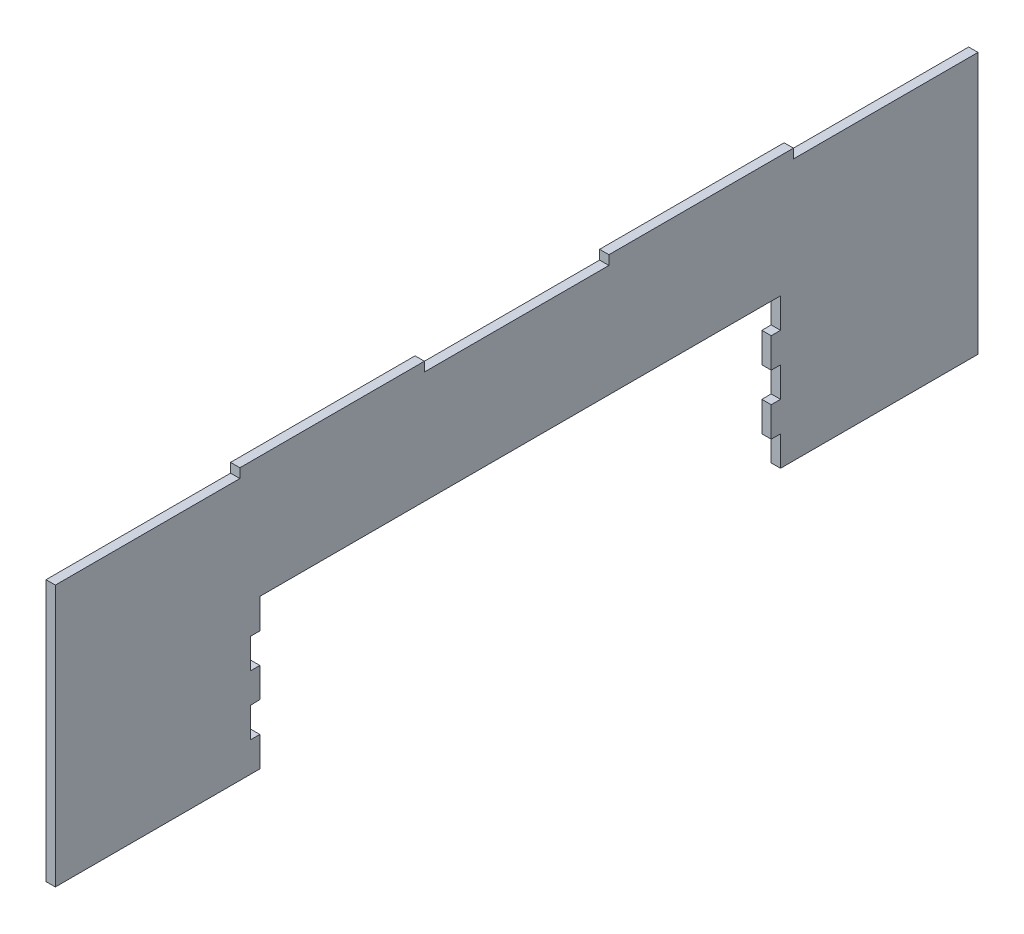
ISO-10303-21;
HEADER;
FILE_DESCRIPTION(('STEP AP214'),'2;1');
FILE_NAME('part.step','',(''),(''),'','','');
FILE_SCHEMA(('AUTOMOTIVE_DESIGN { 1 0 10303 214 1 1 1 1 }'));
ENDSEC;
DATA;
#1=APPLICATION_CONTEXT('core data for automotive mechanical design processes');
#2=APPLICATION_PROTOCOL_DEFINITION('international standard','automotive_design',2000,#1);
#3=PRODUCT_CONTEXT('',#1,'mechanical');
#4=PRODUCT('Part','Part','',(#3));
#5=PRODUCT_RELATED_PRODUCT_CATEGORY('part','',(#4));
#6=PRODUCT_DEFINITION_FORMATION('','',#4);
#7=PRODUCT_DEFINITION_CONTEXT('part definition',#1,'design');
#8=PRODUCT_DEFINITION('design','',#6,#7);
#9=PRODUCT_DEFINITION_SHAPE('','',#8);
#10=(LENGTH_UNIT() NAMED_UNIT(*) SI_UNIT(.MILLI.,.METRE.));
#11=(NAMED_UNIT(*) PLANE_ANGLE_UNIT() SI_UNIT($,.RADIAN.));
#12=(NAMED_UNIT(*) SI_UNIT($,.STERADIAN.) SOLID_ANGLE_UNIT());
#13=UNCERTAINTY_MEASURE_WITH_UNIT(LENGTH_MEASURE(1.E-05),#10,'distance_accuracy_value','');
#14=(GEOMETRIC_REPRESENTATION_CONTEXT(3) GLOBAL_UNCERTAINTY_ASSIGNED_CONTEXT((#13)) GLOBAL_UNIT_ASSIGNED_CONTEXT((#10,
#11,#12)) REPRESENTATION_CONTEXT('',''));
#15=CARTESIAN_POINT('',(0.,0.,0.));
#16=DIRECTION('',(0.,0.,1.));
#17=DIRECTION('',(1.,0.,0.));
#18=AXIS2_PLACEMENT_3D('',#15,#16,#17);
#19=CARTESIAN_POINT('',(5.,-72.5,-141.262721236259));
#20=DIRECTION('',(0.,1.,0.));
#21=DIRECTION('',(0.,0.,1.));
#22=AXIS2_PLACEMENT_3D('',#19,#20,#21);
#23=PLANE('',#22);
#24=DIRECTION('',(0.,0.,-1.));
#25=VECTOR('',#24,1.);
#26=CARTESIAN_POINT('',(0.,-72.5,-141.262721236259));
#27=LINE('',#26,#25);
#28=CARTESIAN_POINT('',(0.,-72.5,-141.262721236259));
#29=VERTEX_POINT('',#28);
#30=CARTESIAN_POINT('',(0.,-72.5,-247.));
#31=VERTEX_POINT('',#30);
#32=EDGE_CURVE('E273',#29,#31,#27,.T.);
#33=ORIENTED_EDGE('',*,*,#32,.T.);
#34=DIRECTION('',(-1.,0.,0.));
#35=VECTOR('',#34,1.);
#36=CARTESIAN_POINT('',(5.,-72.5,-247.));
#37=LINE('',#36,#35);
#38=CARTESIAN_POINT('',(5.,-72.5,-247.));
#39=VERTEX_POINT('',#38);
#40=EDGE_CURVE('E11',#39,#31,#37,.T.);
#41=ORIENTED_EDGE('',*,*,#40,.F.);
#42=DIRECTION('',(0.,0.,-1.));
#43=VECTOR('',#42,1.);
#44=CARTESIAN_POINT('',(5.,-72.5,-141.262721236259));
#45=LINE('',#44,#43);
#46=CARTESIAN_POINT('',(5.,-72.5,-141.262721236259));
#47=VERTEX_POINT('',#46);
#48=EDGE_CURVE('E336',#47,#39,#45,.T.);
#49=ORIENTED_EDGE('',*,*,#48,.F.);
#50=DIRECTION('',(-1.,0.,0.));
#51=VECTOR('',#50,1.);
#52=CARTESIAN_POINT('',(5.,-72.5,-141.262721236259));
#53=LINE('',#52,#51);
#54=EDGE_CURVE('E269',#47,#29,#53,.T.);
#55=ORIENTED_EDGE('',*,*,#54,.T.);
#56=EDGE_LOOP('',(#33,#41,#49,#55));
#57=FACE_BOUND('',#56,.T.);
#58=ADVANCED_FACE('F33',(#57),#23,.F.);
#59=CARTESIAN_POINT('',(5.,67.5,-247.));
#60=DIRECTION('',(0.,0.,1.));
#61=DIRECTION('',(0.,-1.,0.));
#62=AXIS2_PLACEMENT_3D('',#59,#60,#61);
#63=PLANE('',#62);
#64=DIRECTION('',(0.,1.,0.));
#65=VECTOR('',#64,1.);
#66=CARTESIAN_POINT('',(0.,67.5,-247.));
#67=LINE('',#66,#65);
#68=CARTESIAN_POINT('',(0.,67.5,-247.));
#69=VERTEX_POINT('',#68);
#70=EDGE_CURVE('E276',#31,#69,#67,.T.);
#71=ORIENTED_EDGE('',*,*,#70,.T.);
#72=DIRECTION('',(-1.,0.,0.));
#73=VECTOR('',#72,1.);
#74=CARTESIAN_POINT('',(5.,67.5,-247.));
#75=LINE('',#74,#73);
#76=CARTESIAN_POINT('',(5.,67.5,-247.));
#77=VERTEX_POINT('',#76);
#78=EDGE_CURVE('E41',#77,#69,#75,.T.);
#79=ORIENTED_EDGE('',*,*,#78,.F.);
#80=DIRECTION('',(0.,1.,0.));
#81=VECTOR('',#80,1.);
#82=CARTESIAN_POINT('',(5.,67.5,-247.));
#83=LINE('',#82,#81);
#84=EDGE_CURVE('E164',#39,#77,#83,.T.);
#85=ORIENTED_EDGE('',*,*,#84,.F.);
#86=ORIENTED_EDGE('',*,*,#40,.T.);
#87=EDGE_LOOP('',(#71,#79,#85,#86));
#88=FACE_BOUND('',#87,.T.);
#89=ADVANCED_FACE('F514',(#88),#63,.F.);
#90=CARTESIAN_POINT('',(5.,67.5,-148.2));
#91=DIRECTION('',(0.,-1.,0.));
#92=DIRECTION('',(0.,0.,-1.));
#93=AXIS2_PLACEMENT_3D('',#90,#91,#92);
#94=PLANE('',#93);
#95=DIRECTION('',(0.,0.,1.));
#96=VECTOR('',#95,1.);
#97=CARTESIAN_POINT('',(0.,67.5,-148.2));
#98=LINE('',#97,#96);
#99=CARTESIAN_POINT('',(0.,67.5,-148.2));
#100=VERTEX_POINT('',#99);
#101=EDGE_CURVE('E278',#69,#100,#98,.T.);
#102=ORIENTED_EDGE('',*,*,#101,.T.);
#103=DIRECTION('',(-1.,0.,0.));
#104=VECTOR('',#103,1.);
#105=CARTESIAN_POINT('',(5.,67.5,-148.2));
#106=LINE('',#105,#104);
#107=CARTESIAN_POINT('',(5.,67.5,-148.2));
#108=VERTEX_POINT('',#107);
#109=EDGE_CURVE('E415',#108,#100,#106,.T.);
#110=ORIENTED_EDGE('',*,*,#109,.F.);
#111=DIRECTION('',(0.,0.,1.));
#112=VECTOR('',#111,1.);
#113=CARTESIAN_POINT('',(5.,67.5,-148.2));
#114=LINE('',#113,#112);
#115=EDGE_CURVE('E423',#77,#108,#114,.T.);
#116=ORIENTED_EDGE('',*,*,#115,.F.);
#117=ORIENTED_EDGE('',*,*,#78,.T.);
#118=EDGE_LOOP('',(#102,#110,#116,#117));
#119=FACE_BOUND('',#118,.T.);
#120=ADVANCED_FACE('F421',(#119),#94,.F.);
#121=CARTESIAN_POINT('',(5.,72.5,-148.2));
#122=DIRECTION('',(0.,0.,1.));
#123=DIRECTION('',(1.,0.,0.));
#124=AXIS2_PLACEMENT_3D('',#121,#122,#123);
#125=PLANE('',#124);
#126=DIRECTION('',(0.,1.,0.));
#127=VECTOR('',#126,1.);
#128=CARTESIAN_POINT('',(0.,72.5,-148.2));
#129=LINE('',#128,#127);
#130=CARTESIAN_POINT('',(0.,72.5,-148.2));
#131=VERTEX_POINT('',#130);
#132=EDGE_CURVE('E280',#100,#131,#129,.T.);
#133=ORIENTED_EDGE('',*,*,#132,.T.);
#134=DIRECTION('',(-1.,0.,0.));
#135=VECTOR('',#134,1.);
#136=CARTESIAN_POINT('',(5.,72.5,-148.2));
#137=LINE('',#136,#135);
#138=CARTESIAN_POINT('',(5.,72.5,-148.2));
#139=VERTEX_POINT('',#138);
#140=EDGE_CURVE('E412',#139,#131,#137,.T.);
#141=ORIENTED_EDGE('',*,*,#140,.F.);
#142=DIRECTION('',(0.,1.,0.));
#143=VECTOR('',#142,1.);
#144=CARTESIAN_POINT('',(5.,72.5,-148.2));
#145=LINE('',#144,#143);
#146=EDGE_CURVE('E441',#108,#139,#145,.T.);
#147=ORIENTED_EDGE('',*,*,#146,.F.);
#148=ORIENTED_EDGE('',*,*,#109,.T.);
#149=EDGE_LOOP('',(#133,#141,#147,#148));
#150=FACE_BOUND('',#149,.T.);
#151=ADVANCED_FACE('F432',(#150),#125,.F.);
#152=CARTESIAN_POINT('',(5.,72.5,-49.4));
#153=DIRECTION('',(0.,-1.,0.));
#154=DIRECTION('',(0.,0.,-1.));
#155=AXIS2_PLACEMENT_3D('',#152,#153,#154);
#156=PLANE('',#155);
#157=DIRECTION('',(0.,0.,1.));
#158=VECTOR('',#157,1.);
#159=CARTESIAN_POINT('',(0.,72.5,-49.4));
#160=LINE('',#159,#158);
#161=CARTESIAN_POINT('',(0.,72.5,-49.4));
#162=VERTEX_POINT('',#161);
#163=EDGE_CURVE('E282',#131,#162,#160,.T.);
#164=ORIENTED_EDGE('',*,*,#163,.T.);
#165=DIRECTION('',(-1.,0.,0.));
#166=VECTOR('',#165,1.);
#167=CARTESIAN_POINT('',(5.,72.5,-49.4));
#168=LINE('',#167,#166);
#169=CARTESIAN_POINT('',(5.,72.5,-49.4));
#170=VERTEX_POINT('',#169);
#171=EDGE_CURVE('E409',#170,#162,#168,.T.);
#172=ORIENTED_EDGE('',*,*,#171,.F.);
#173=DIRECTION('',(0.,0.,1.));
#174=VECTOR('',#173,1.);
#175=CARTESIAN_POINT('',(5.,72.5,-49.4));
#176=LINE('',#175,#174);
#177=EDGE_CURVE('E438',#139,#170,#176,.T.);
#178=ORIENTED_EDGE('',*,*,#177,.F.);
#179=ORIENTED_EDGE('',*,*,#140,.T.);
#180=EDGE_LOOP('',(#164,#172,#178,#179));
#181=FACE_BOUND('',#180,.T.);
#182=ADVANCED_FACE('F436',(#181),#156,.F.);
#183=CARTESIAN_POINT('',(5.,72.5,-49.4));
#184=DIRECTION('',(0.,0.,-1.));
#185=DIRECTION('',(0.,1.,0.));
#186=AXIS2_PLACEMENT_3D('',#183,#184,#185);
#187=PLANE('',#186);
#188=DIRECTION('',(0.,-1.,0.));
#189=VECTOR('',#188,1.);
#190=CARTESIAN_POINT('',(0.,72.5,-49.4));
#191=LINE('',#190,#189);
#192=CARTESIAN_POINT('',(0.,67.5,-49.4));
#193=VERTEX_POINT('',#192);
#194=EDGE_CURVE('E284',#162,#193,#191,.T.);
#195=ORIENTED_EDGE('',*,*,#194,.T.);
#196=DIRECTION('',(-1.,0.,0.));
#197=VECTOR('',#196,1.);
#198=CARTESIAN_POINT('',(5.,67.5,-49.4));
#199=LINE('',#198,#197);
#200=CARTESIAN_POINT('',(5.,67.5,-49.4));
#201=VERTEX_POINT('',#200);
#202=EDGE_CURVE('E406',#201,#193,#199,.T.);
#203=ORIENTED_EDGE('',*,*,#202,.F.);
#204=DIRECTION('',(0.,-1.,0.));
#205=VECTOR('',#204,1.);
#206=CARTESIAN_POINT('',(5.,72.5,-49.4));
#207=LINE('',#206,#205);
#208=EDGE_CURVE('E440',#170,#201,#207,.T.);
#209=ORIENTED_EDGE('',*,*,#208,.F.);
#210=ORIENTED_EDGE('',*,*,#171,.T.);
#211=EDGE_LOOP('',(#195,#203,#209,#210));
#212=FACE_BOUND('',#211,.T.);
#213=ADVANCED_FACE('F527',(#212),#187,.F.);
#214=CARTESIAN_POINT('',(5.,67.5,49.4));
#215=DIRECTION('',(0.,-1.,0.));
#216=DIRECTION('',(0.,0.,-1.));
#217=AXIS2_PLACEMENT_3D('',#214,#215,#216);
#218=PLANE('',#217);
#219=DIRECTION('',(0.,0.,1.));
#220=VECTOR('',#219,1.);
#221=CARTESIAN_POINT('',(0.,67.5,49.4));
#222=LINE('',#221,#220);
#223=CARTESIAN_POINT('',(0.,67.5,49.4));
#224=VERTEX_POINT('',#223);
#225=EDGE_CURVE('E286',#193,#224,#222,.T.);
#226=ORIENTED_EDGE('',*,*,#225,.T.);
#227=DIRECTION('',(-1.,0.,0.));
#228=VECTOR('',#227,1.);
#229=CARTESIAN_POINT('',(5.,67.5,49.4));
#230=LINE('',#229,#228);
#231=CARTESIAN_POINT('',(5.,67.5,49.4));
#232=VERTEX_POINT('',#231);
#233=EDGE_CURVE('E403',#232,#224,#230,.T.);
#234=ORIENTED_EDGE('',*,*,#233,.F.);
#235=DIRECTION('',(0.,0.,1.));
#236=VECTOR('',#235,1.);
#237=CARTESIAN_POINT('',(5.,67.5,49.4));
#238=LINE('',#237,#236);
#239=EDGE_CURVE('E443',#201,#232,#238,.T.);
#240=ORIENTED_EDGE('',*,*,#239,.F.);
#241=ORIENTED_EDGE('',*,*,#202,.T.);
#242=EDGE_LOOP('',(#226,#234,#240,#241));
#243=FACE_BOUND('',#242,.T.);
#244=ADVANCED_FACE('F530',(#243),#218,.F.);
#245=CARTESIAN_POINT('',(5.,72.5,49.4));
#246=DIRECTION('',(0.,0.,1.));
#247=DIRECTION('',(1.,0.,0.));
#248=AXIS2_PLACEMENT_3D('',#245,#246,#247);
#249=PLANE('',#248);
#250=DIRECTION('',(0.,1.,0.));
#251=VECTOR('',#250,1.);
#252=CARTESIAN_POINT('',(0.,72.5,49.4));
#253=LINE('',#252,#251);
#254=CARTESIAN_POINT('',(0.,72.5,49.4));
#255=VERTEX_POINT('',#254);
#256=EDGE_CURVE('E288',#224,#255,#253,.T.);
#257=ORIENTED_EDGE('',*,*,#256,.T.);
#258=DIRECTION('',(-1.,0.,0.));
#259=VECTOR('',#258,1.);
#260=CARTESIAN_POINT('',(5.,72.5,49.4));
#261=LINE('',#260,#259);
#262=CARTESIAN_POINT('',(5.,72.5,49.4));
#263=VERTEX_POINT('',#262);
#264=EDGE_CURVE('E400',#263,#255,#261,.T.);
#265=ORIENTED_EDGE('',*,*,#264,.F.);
#266=DIRECTION('',(0.,1.,0.));
#267=VECTOR('',#266,1.);
#268=CARTESIAN_POINT('',(5.,72.5,49.4));
#269=LINE('',#268,#267);
#270=EDGE_CURVE('E449',#232,#263,#269,.T.);
#271=ORIENTED_EDGE('',*,*,#270,.F.);
#272=ORIENTED_EDGE('',*,*,#233,.T.);
#273=EDGE_LOOP('',(#257,#265,#271,#272));
#274=FACE_BOUND('',#273,.T.);
#275=ADVANCED_FACE('F534',(#274),#249,.F.);
#276=CARTESIAN_POINT('',(5.,72.5,148.2));
#277=DIRECTION('',(0.,-1.,0.));
#278=DIRECTION('',(0.,0.,-1.));
#279=AXIS2_PLACEMENT_3D('',#276,#277,#278);
#280=PLANE('',#279);
#281=DIRECTION('',(0.,0.,1.));
#282=VECTOR('',#281,1.);
#283=CARTESIAN_POINT('',(0.,72.5,148.2));
#284=LINE('',#283,#282);
#285=CARTESIAN_POINT('',(0.,72.5,148.2));
#286=VERTEX_POINT('',#285);
#287=EDGE_CURVE('E290',#255,#286,#284,.T.);
#288=ORIENTED_EDGE('',*,*,#287,.T.);
#289=DIRECTION('',(-1.,0.,0.));
#290=VECTOR('',#289,1.);
#291=CARTESIAN_POINT('',(5.,72.5,148.2));
#292=LINE('',#291,#290);
#293=CARTESIAN_POINT('',(5.,72.5,148.2));
#294=VERTEX_POINT('',#293);
#295=EDGE_CURVE('E397',#294,#286,#292,.T.);
#296=ORIENTED_EDGE('',*,*,#295,.F.);
#297=DIRECTION('',(0.,0.,1.));
#298=VECTOR('',#297,1.);
#299=CARTESIAN_POINT('',(5.,72.5,148.2));
#300=LINE('',#299,#298);
#301=EDGE_CURVE('E451',#263,#294,#300,.T.);
#302=ORIENTED_EDGE('',*,*,#301,.F.);
#303=ORIENTED_EDGE('',*,*,#264,.T.);
#304=EDGE_LOOP('',(#288,#296,#302,#303));
#305=FACE_BOUND('',#304,.T.);
#306=ADVANCED_FACE('F538',(#305),#280,.F.);
#307=CARTESIAN_POINT('',(5.,72.5,148.2));
#308=DIRECTION('',(0.,0.,-1.));
#309=DIRECTION('',(-1.,0.,0.));
#310=AXIS2_PLACEMENT_3D('',#307,#308,#309);
#311=PLANE('',#310);
#312=DIRECTION('',(0.,-1.,0.));
#313=VECTOR('',#312,1.);
#314=CARTESIAN_POINT('',(0.,72.5,148.2));
#315=LINE('',#314,#313);
#316=CARTESIAN_POINT('',(0.,67.5,148.2));
#317=VERTEX_POINT('',#316);
#318=EDGE_CURVE('E292',#286,#317,#315,.T.);
#319=ORIENTED_EDGE('',*,*,#318,.T.);
#320=DIRECTION('',(-1.,0.,0.));
#321=VECTOR('',#320,1.);
#322=CARTESIAN_POINT('',(5.,67.5,148.2));
#323=LINE('',#322,#321);
#324=CARTESIAN_POINT('',(5.,67.5,148.2));
#325=VERTEX_POINT('',#324);
#326=EDGE_CURVE('E394',#325,#317,#323,.T.);
#327=ORIENTED_EDGE('',*,*,#326,.F.);
#328=DIRECTION('',(0.,-1.,0.));
#329=VECTOR('',#328,1.);
#330=CARTESIAN_POINT('',(5.,72.5,148.2));
#331=LINE('',#330,#329);
#332=EDGE_CURVE('E453',#294,#325,#331,.T.);
#333=ORIENTED_EDGE('',*,*,#332,.F.);
#334=ORIENTED_EDGE('',*,*,#295,.T.);
#335=EDGE_LOOP('',(#319,#327,#333,#334));
#336=FACE_BOUND('',#335,.T.);
#337=ADVANCED_FACE('F542',(#336),#311,.F.);
#338=CARTESIAN_POINT('',(5.,67.5,247.));
#339=DIRECTION('',(0.,-1.,0.));
#340=DIRECTION('',(0.,0.,-1.));
#341=AXIS2_PLACEMENT_3D('',#338,#339,#340);
#342=PLANE('',#341);
#343=DIRECTION('',(0.,0.,1.));
#344=VECTOR('',#343,1.);
#345=CARTESIAN_POINT('',(0.,67.5,247.));
#346=LINE('',#345,#344);
#347=CARTESIAN_POINT('',(0.,67.5,247.));
#348=VERTEX_POINT('',#347);
#349=EDGE_CURVE('E294',#317,#348,#346,.T.);
#350=ORIENTED_EDGE('',*,*,#349,.T.);
#351=DIRECTION('',(-1.,0.,0.));
#352=VECTOR('',#351,1.);
#353=CARTESIAN_POINT('',(5.,67.5,247.));
#354=LINE('',#353,#352);
#355=CARTESIAN_POINT('',(5.,67.5,247.));
#356=VERTEX_POINT('',#355);
#357=EDGE_CURVE('E391',#356,#348,#354,.T.);
#358=ORIENTED_EDGE('',*,*,#357,.F.);
#359=DIRECTION('',(0.,0.,1.));
#360=VECTOR('',#359,1.);
#361=CARTESIAN_POINT('',(5.,67.5,247.));
#362=LINE('',#361,#360);
#363=EDGE_CURVE('E455',#325,#356,#362,.T.);
#364=ORIENTED_EDGE('',*,*,#363,.F.);
#365=ORIENTED_EDGE('',*,*,#326,.T.);
#366=EDGE_LOOP('',(#350,#358,#364,#365));
#367=FACE_BOUND('',#366,.T.);
#368=ADVANCED_FACE('F546',(#367),#342,.F.);
#369=CARTESIAN_POINT('',(5.,67.5,247.));
#370=DIRECTION('',(0.,0.,-1.));
#371=DIRECTION('',(0.,1.,0.));
#372=AXIS2_PLACEMENT_3D('',#369,#370,#371);
#373=PLANE('',#372);
#374=DIRECTION('',(0.,-1.,0.));
#375=VECTOR('',#374,1.);
#376=CARTESIAN_POINT('',(0.,67.5,247.));
#377=LINE('',#376,#375);
#378=CARTESIAN_POINT('',(0.,-72.5,247.));
#379=VERTEX_POINT('',#378);
#380=EDGE_CURVE('E296',#348,#379,#377,.T.);
#381=ORIENTED_EDGE('',*,*,#380,.T.);
#382=DIRECTION('',(-1.,0.,0.));
#383=VECTOR('',#382,1.);
#384=CARTESIAN_POINT('',(5.,-72.5,247.));
#385=LINE('',#384,#383);
#386=CARTESIAN_POINT('',(5.,-72.5,247.));
#387=VERTEX_POINT('',#386);
#388=EDGE_CURVE('E388',#387,#379,#385,.T.);
#389=ORIENTED_EDGE('',*,*,#388,.F.);
#390=DIRECTION('',(0.,-1.,0.));
#391=VECTOR('',#390,1.);
#392=CARTESIAN_POINT('',(5.,67.5,247.));
#393=LINE('',#392,#391);
#394=EDGE_CURVE('E457',#356,#387,#393,.T.);
#395=ORIENTED_EDGE('',*,*,#394,.F.);
#396=ORIENTED_EDGE('',*,*,#357,.T.);
#397=EDGE_LOOP('',(#381,#389,#395,#396));
#398=FACE_BOUND('',#397,.T.);
#399=ADVANCED_FACE('F550',(#398),#373,.F.);
#400=CARTESIAN_POINT('',(5.,-72.5,247.));
#401=DIRECTION('',(0.,1.,0.));
#402=DIRECTION('',(0.,0.,1.));
#403=AXIS2_PLACEMENT_3D('',#400,#401,#402);
#404=PLANE('',#403);
#405=DIRECTION('',(0.,0.,-1.));
#406=VECTOR('',#405,1.);
#407=CARTESIAN_POINT('',(0.,-72.5,247.));
#408=LINE('',#407,#406);
#409=CARTESIAN_POINT('',(0.,-72.5,137.5));
#410=VERTEX_POINT('',#409);
#411=EDGE_CURVE('E298',#379,#410,#408,.T.);
#412=ORIENTED_EDGE('',*,*,#411,.T.);
#413=DIRECTION('',(-1.,0.,0.));
#414=VECTOR('',#413,1.);
#415=CARTESIAN_POINT('',(5.,-72.5,137.5));
#416=LINE('',#415,#414);
#417=CARTESIAN_POINT('',(5.,-72.5,137.5));
#418=VERTEX_POINT('',#417);
#419=EDGE_CURVE('E385',#418,#410,#416,.T.);
#420=ORIENTED_EDGE('',*,*,#419,.F.);
#421=DIRECTION('',(0.,0.,-1.));
#422=VECTOR('',#421,1.);
#423=CARTESIAN_POINT('',(5.,-72.5,247.));
#424=LINE('',#423,#422);
#425=EDGE_CURVE('E459',#387,#418,#424,.T.);
#426=ORIENTED_EDGE('',*,*,#425,.F.);
#427=ORIENTED_EDGE('',*,*,#388,.T.);
#428=EDGE_LOOP('',(#412,#420,#426,#427));
#429=FACE_BOUND('',#428,.T.);
#430=ADVANCED_FACE('F554',(#429),#404,.F.);
#431=CARTESIAN_POINT('',(5.,-72.5,137.5));
#432=DIRECTION('',(0.,0.,1.));
#433=DIRECTION('',(1.,0.,0.));
#434=AXIS2_PLACEMENT_3D('',#431,#432,#433);
#435=PLANE('',#434);
#436=DIRECTION('',(0.,1.,0.));
#437=VECTOR('',#436,1.);
#438=CARTESIAN_POINT('',(0.,-72.5,137.5));
#439=LINE('',#438,#437);
#440=CARTESIAN_POINT('',(0.,-56.5,137.5));
#441=VERTEX_POINT('',#440);
#442=EDGE_CURVE('E300',#410,#441,#439,.T.);
#443=ORIENTED_EDGE('',*,*,#442,.T.);
#444=DIRECTION('',(-1.,0.,0.));
#445=VECTOR('',#444,1.);
#446=CARTESIAN_POINT('',(5.,-56.5,137.5));
#447=LINE('',#446,#445);
#448=CARTESIAN_POINT('',(5.,-56.5,137.5));
#449=VERTEX_POINT('',#448);
#450=EDGE_CURVE('E382',#449,#441,#447,.T.);
#451=ORIENTED_EDGE('',*,*,#450,.F.);
#452=DIRECTION('',(0.,1.,0.));
#453=VECTOR('',#452,1.);
#454=CARTESIAN_POINT('',(5.,-72.5,137.5));
#455=LINE('',#454,#453);
#456=EDGE_CURVE('E461',#418,#449,#455,.T.);
#457=ORIENTED_EDGE('',*,*,#456,.F.);
#458=ORIENTED_EDGE('',*,*,#419,.T.);
#459=EDGE_LOOP('',(#443,#451,#457,#458));
#460=FACE_BOUND('',#459,.T.);
#461=ADVANCED_FACE('F558',(#460),#435,.F.);
#462=CARTESIAN_POINT('',(5.,-56.5,142.5));
#463=DIRECTION('',(0.,-1.,0.));
#464=DIRECTION('',(0.,0.,-1.));
#465=AXIS2_PLACEMENT_3D('',#462,#463,#464);
#466=PLANE('',#465);
#467=DIRECTION('',(0.,0.,1.));
#468=VECTOR('',#467,1.);
#469=CARTESIAN_POINT('',(0.,-56.5,142.5));
#470=LINE('',#469,#468);
#471=CARTESIAN_POINT('',(0.,-56.5,142.5));
#472=VERTEX_POINT('',#471);
#473=EDGE_CURVE('E302',#441,#472,#470,.T.);
#474=ORIENTED_EDGE('',*,*,#473,.T.);
#475=DIRECTION('',(-1.,0.,0.));
#476=VECTOR('',#475,1.);
#477=CARTESIAN_POINT('',(5.,-56.5,142.5));
#478=LINE('',#477,#476);
#479=CARTESIAN_POINT('',(5.,-56.5,142.5));
#480=VERTEX_POINT('',#479);
#481=EDGE_CURVE('E379',#480,#472,#478,.T.);
#482=ORIENTED_EDGE('',*,*,#481,.F.);
#483=DIRECTION('',(0.,0.,1.));
#484=VECTOR('',#483,1.);
#485=CARTESIAN_POINT('',(5.,-56.5,142.5));
#486=LINE('',#485,#484);
#487=EDGE_CURVE('E463',#449,#480,#486,.T.);
#488=ORIENTED_EDGE('',*,*,#487,.F.);
#489=ORIENTED_EDGE('',*,*,#450,.T.);
#490=EDGE_LOOP('',(#474,#482,#488,#489));
#491=FACE_BOUND('',#490,.T.);
#492=ADVANCED_FACE('F562',(#491),#466,.F.);
#493=CARTESIAN_POINT('',(5.,-40.5,142.5));
#494=DIRECTION('',(0.,0.,1.));
#495=DIRECTION('',(1.,0.,0.));
#496=AXIS2_PLACEMENT_3D('',#493,#494,#495);
#497=PLANE('',#496);
#498=DIRECTION('',(0.,1.,0.));
#499=VECTOR('',#498,1.);
#500=CARTESIAN_POINT('',(0.,-40.5,142.5));
#501=LINE('',#500,#499);
#502=CARTESIAN_POINT('',(0.,-40.5,142.5));
#503=VERTEX_POINT('',#502);
#504=EDGE_CURVE('E304',#472,#503,#501,.T.);
#505=ORIENTED_EDGE('',*,*,#504,.T.);
#506=DIRECTION('',(-1.,0.,0.));
#507=VECTOR('',#506,1.);
#508=CARTESIAN_POINT('',(5.,-40.5,142.5));
#509=LINE('',#508,#507);
#510=CARTESIAN_POINT('',(5.,-40.5,142.5));
#511=VERTEX_POINT('',#510);
#512=EDGE_CURVE('E376',#511,#503,#509,.T.);
#513=ORIENTED_EDGE('',*,*,#512,.F.);
#514=DIRECTION('',(0.,1.,0.));
#515=VECTOR('',#514,1.);
#516=CARTESIAN_POINT('',(5.,-40.5,142.5));
#517=LINE('',#516,#515);
#518=EDGE_CURVE('E465',#480,#511,#517,.T.);
#519=ORIENTED_EDGE('',*,*,#518,.F.);
#520=ORIENTED_EDGE('',*,*,#481,.T.);
#521=EDGE_LOOP('',(#505,#513,#519,#520));
#522=FACE_BOUND('',#521,.T.);
#523=ADVANCED_FACE('F566',(#522),#497,.F.);
#524=CARTESIAN_POINT('',(5.,-40.5,142.5));
#525=DIRECTION('',(0.,0.999604371182129,0.0281265197559325));
#526=DIRECTION('',(0.,-0.0281265197559325,0.999604371182129));
#527=AXIS2_PLACEMENT_3D('',#524,#525,#526);
#528=PLANE('',#527);
#529=DIRECTION('',(0.,0.0281265197559325,-0.999604371182129));
#530=VECTOR('',#529,1.);
#531=CARTESIAN_POINT('',(0.,-40.5,142.5));
#532=LINE('',#531,#530);
#533=CARTESIAN_POINT('',(0.,-40.3593117408907,137.5));
#534=VERTEX_POINT('',#533);
#535=EDGE_CURVE('E306',#503,#534,#532,.T.);
#536=ORIENTED_EDGE('',*,*,#535,.T.);
#537=DIRECTION('',(-1.,0.,0.));
#538=VECTOR('',#537,1.);
#539=CARTESIAN_POINT('',(5.,-40.3593117408907,137.5));
#540=LINE('',#539,#538);
#541=CARTESIAN_POINT('',(5.,-40.3593117408907,137.5));
#542=VERTEX_POINT('',#541);
#543=EDGE_CURVE('E373',#542,#534,#540,.T.);
#544=ORIENTED_EDGE('',*,*,#543,.F.);
#545=DIRECTION('',(0.,0.0281265197559325,-0.999604371182129));
#546=VECTOR('',#545,1.);
#547=CARTESIAN_POINT('',(5.,-40.5,142.5));
#548=LINE('',#547,#546);
#549=EDGE_CURVE('E467',#511,#542,#548,.T.);
#550=ORIENTED_EDGE('',*,*,#549,.F.);
#551=ORIENTED_EDGE('',*,*,#512,.T.);
#552=EDGE_LOOP('',(#536,#544,#550,#551));
#553=FACE_BOUND('',#552,.T.);
#554=ADVANCED_FACE('F570',(#553),#528,.F.);
#555=CARTESIAN_POINT('',(5.,-40.3593117408907,137.5));
#556=DIRECTION('',(0.,0.,1.));
#557=DIRECTION('',(0.,-1.,0.));
#558=AXIS2_PLACEMENT_3D('',#555,#556,#557);
#559=PLANE('',#558);
#560=DIRECTION('',(0.,1.,0.));
#561=VECTOR('',#560,1.);
#562=CARTESIAN_POINT('',(0.,-40.3593117408907,137.5));
#563=LINE('',#562,#561);
#564=CARTESIAN_POINT('',(0.,-24.5,137.5));
#565=VERTEX_POINT('',#564);
#566=EDGE_CURVE('E308',#534,#565,#563,.T.);
#567=ORIENTED_EDGE('',*,*,#566,.T.);
#568=DIRECTION('',(-1.,0.,0.));
#569=VECTOR('',#568,1.);
#570=CARTESIAN_POINT('',(5.,-24.5,137.5));
#571=LINE('',#570,#569);
#572=CARTESIAN_POINT('',(5.,-24.5,137.5));
#573=VERTEX_POINT('',#572);
#574=EDGE_CURVE('E370',#573,#565,#571,.T.);
#575=ORIENTED_EDGE('',*,*,#574,.F.);
#576=DIRECTION('',(0.,1.,0.));
#577=VECTOR('',#576,1.);
#578=CARTESIAN_POINT('',(5.,-40.3593117408907,137.5));
#579=LINE('',#578,#577);
#580=EDGE_CURVE('E469',#542,#573,#579,.T.);
#581=ORIENTED_EDGE('',*,*,#580,.F.);
#582=ORIENTED_EDGE('',*,*,#543,.T.);
#583=EDGE_LOOP('',(#567,#575,#581,#582));
#584=FACE_BOUND('',#583,.T.);
#585=ADVANCED_FACE('F574',(#584),#559,.F.);
#586=CARTESIAN_POINT('',(5.,-24.5,142.5));
#587=DIRECTION('',(0.,-1.,0.));
#588=DIRECTION('',(0.,0.,-1.));
#589=AXIS2_PLACEMENT_3D('',#586,#587,#588);
#590=PLANE('',#589);
#591=DIRECTION('',(0.,0.,1.));
#592=VECTOR('',#591,1.);
#593=CARTESIAN_POINT('',(0.,-24.5,142.5));
#594=LINE('',#593,#592);
#595=CARTESIAN_POINT('',(0.,-24.5,142.5));
#596=VERTEX_POINT('',#595);
#597=EDGE_CURVE('E310',#565,#596,#594,.T.);
#598=ORIENTED_EDGE('',*,*,#597,.T.);
#599=DIRECTION('',(-1.,0.,0.));
#600=VECTOR('',#599,1.);
#601=CARTESIAN_POINT('',(5.,-24.5,142.5));
#602=LINE('',#601,#600);
#603=CARTESIAN_POINT('',(5.,-24.5,142.5));
#604=VERTEX_POINT('',#603);
#605=EDGE_CURVE('E367',#604,#596,#602,.T.);
#606=ORIENTED_EDGE('',*,*,#605,.F.);
#607=DIRECTION('',(0.,0.,1.));
#608=VECTOR('',#607,1.);
#609=CARTESIAN_POINT('',(5.,-24.5,142.5));
#610=LINE('',#609,#608);
#611=EDGE_CURVE('E471',#573,#604,#610,.T.);
#612=ORIENTED_EDGE('',*,*,#611,.F.);
#613=ORIENTED_EDGE('',*,*,#574,.T.);
#614=EDGE_LOOP('',(#598,#606,#612,#613));
#615=FACE_BOUND('',#614,.T.);
#616=ADVANCED_FACE('F578',(#615),#590,.F.);
#617=CARTESIAN_POINT('',(5.,-8.50000000000001,142.5));
#618=DIRECTION('',(0.,0.,1.));
#619=DIRECTION('',(1.,0.,0.));
#620=AXIS2_PLACEMENT_3D('',#617,#618,#619);
#621=PLANE('',#620);
#622=DIRECTION('',(0.,1.,0.));
#623=VECTOR('',#622,1.);
#624=CARTESIAN_POINT('',(0.,-8.50000000000001,142.5));
#625=LINE('',#624,#623);
#626=CARTESIAN_POINT('',(0.,-8.50000000000001,142.5));
#627=VERTEX_POINT('',#626);
#628=EDGE_CURVE('E312',#596,#627,#625,.T.);
#629=ORIENTED_EDGE('',*,*,#628,.T.);
#630=DIRECTION('',(-1.,0.,0.));
#631=VECTOR('',#630,1.);
#632=CARTESIAN_POINT('',(5.,-8.50000000000001,142.5));
#633=LINE('',#632,#631);
#634=CARTESIAN_POINT('',(5.,-8.50000000000001,142.5));
#635=VERTEX_POINT('',#634);
#636=EDGE_CURVE('E364',#635,#627,#633,.T.);
#637=ORIENTED_EDGE('',*,*,#636,.F.);
#638=DIRECTION('',(0.,1.,0.));
#639=VECTOR('',#638,1.);
#640=CARTESIAN_POINT('',(5.,-8.50000000000001,142.5));
#641=LINE('',#640,#639);
#642=EDGE_CURVE('E473',#604,#635,#641,.T.);
#643=ORIENTED_EDGE('',*,*,#642,.F.);
#644=ORIENTED_EDGE('',*,*,#605,.T.);
#645=EDGE_LOOP('',(#629,#637,#643,#644));
#646=FACE_BOUND('',#645,.T.);
#647=ADVANCED_FACE('F582',(#646),#621,.F.);
#648=CARTESIAN_POINT('',(5.,-8.50000000000001,142.5));
#649=DIRECTION('',(0.,1.,0.));
#650=DIRECTION('',(0.,0.,1.));
#651=AXIS2_PLACEMENT_3D('',#648,#649,#650);
#652=PLANE('',#651);
#653=DIRECTION('',(0.,0.,-1.));
#654=VECTOR('',#653,1.);
#655=CARTESIAN_POINT('',(0.,-8.50000000000001,142.5));
#656=LINE('',#655,#654);
#657=CARTESIAN_POINT('',(0.,-8.50000000000001,137.5));
#658=VERTEX_POINT('',#657);
#659=EDGE_CURVE('E314',#627,#658,#656,.T.);
#660=ORIENTED_EDGE('',*,*,#659,.T.);
#661=DIRECTION('',(-1.,0.,0.));
#662=VECTOR('',#661,1.);
#663=CARTESIAN_POINT('',(5.,-8.50000000000001,137.5));
#664=LINE('',#663,#662);
#665=CARTESIAN_POINT('',(5.,-8.50000000000001,137.5));
#666=VERTEX_POINT('',#665);
#667=EDGE_CURVE('E361',#666,#658,#664,.T.);
#668=ORIENTED_EDGE('',*,*,#667,.F.);
#669=DIRECTION('',(0.,0.,-1.));
#670=VECTOR('',#669,1.);
#671=CARTESIAN_POINT('',(5.,-8.50000000000001,142.5));
#672=LINE('',#671,#670);
#673=EDGE_CURVE('E475',#635,#666,#672,.T.);
#674=ORIENTED_EDGE('',*,*,#673,.F.);
#675=ORIENTED_EDGE('',*,*,#636,.T.);
#676=EDGE_LOOP('',(#660,#668,#674,#675));
#677=FACE_BOUND('',#676,.T.);
#678=ADVANCED_FACE('F586',(#677),#652,.F.);
#679=CARTESIAN_POINT('',(5.,-8.50000000000001,137.5));
#680=DIRECTION('',(0.,0.,1.));
#681=DIRECTION('',(1.,0.,0.));
#682=AXIS2_PLACEMENT_3D('',#679,#680,#681);
#683=PLANE('',#682);
#684=DIRECTION('',(0.,1.,0.));
#685=VECTOR('',#684,1.);
#686=CARTESIAN_POINT('',(0.,-8.50000000000001,137.5));
#687=LINE('',#686,#685);
#688=CARTESIAN_POINT('',(0.,7.49999999999999,137.5));
#689=VERTEX_POINT('',#688);
#690=EDGE_CURVE('E316',#658,#689,#687,.T.);
#691=ORIENTED_EDGE('',*,*,#690,.T.);
#692=DIRECTION('',(-1.,0.,0.));
#693=VECTOR('',#692,1.);
#694=CARTESIAN_POINT('',(5.,7.49999999999999,137.5));
#695=LINE('',#694,#693);
#696=CARTESIAN_POINT('',(5.,7.49999999999999,137.5));
#697=VERTEX_POINT('',#696);
#698=EDGE_CURVE('E358',#697,#689,#695,.T.);
#699=ORIENTED_EDGE('',*,*,#698,.F.);
#700=DIRECTION('',(0.,1.,0.));
#701=VECTOR('',#700,1.);
#702=CARTESIAN_POINT('',(5.,-8.50000000000001,137.5));
#703=LINE('',#702,#701);
#704=EDGE_CURVE('E477',#666,#697,#703,.T.);
#705=ORIENTED_EDGE('',*,*,#704,.F.);
#706=ORIENTED_EDGE('',*,*,#667,.T.);
#707=EDGE_LOOP('',(#691,#699,#705,#706));
#708=FACE_BOUND('',#707,.T.);
#709=ADVANCED_FACE('F590',(#708),#683,.F.);
#710=CARTESIAN_POINT('',(5.,7.50000000000001,0.));
#711=DIRECTION('',(0.,1.,0.));
#712=DIRECTION('',(0.,0.,1.));
#713=AXIS2_PLACEMENT_3D('',#710,#711,#712);
#714=PLANE('',#713);
#715=DIRECTION('',(0.,0.,-1.));
#716=VECTOR('',#715,1.);
#717=CARTESIAN_POINT('',(0.,7.50000000000001,0.));
#718=LINE('',#717,#716);
#719=CARTESIAN_POINT('',(0.,7.50000000000001,-141.262721236259));
#720=VERTEX_POINT('',#719);
#721=EDGE_CURVE('E319',#689,#720,#718,.T.);
#722=ORIENTED_EDGE('',*,*,#721,.T.);
#723=DIRECTION('',(-1.,0.,0.));
#724=VECTOR('',#723,1.);
#725=CARTESIAN_POINT('',(5.,7.50000000000001,-141.262721236259));
#726=LINE('',#725,#724);
#727=CARTESIAN_POINT('',(5.,7.50000000000001,-141.262721236259));
#728=VERTEX_POINT('',#727);
#729=EDGE_CURVE('E355',#728,#720,#726,.T.);
#730=ORIENTED_EDGE('',*,*,#729,.F.);
#731=DIRECTION('',(0.,0.,-1.));
#732=VECTOR('',#731,1.);
#733=CARTESIAN_POINT('',(5.,7.50000000000001,0.));
#734=LINE('',#733,#732);
#735=EDGE_CURVE('E479',#697,#728,#734,.T.);
#736=ORIENTED_EDGE('',*,*,#735,.F.);
#737=ORIENTED_EDGE('',*,*,#698,.T.);
#738=EDGE_LOOP('',(#722,#730,#736,#737));
#739=FACE_BOUND('',#738,.T.);
#740=ADVANCED_FACE('F594',(#739),#714,.F.);
#741=CARTESIAN_POINT('',(5.,7.50000000000001,-141.262721236259));
#742=DIRECTION('',(0.,0.,-1.));
#743=DIRECTION('',(-1.,0.,0.));
#744=AXIS2_PLACEMENT_3D('',#741,#742,#743);
#745=PLANE('',#744);
#746=DIRECTION('',(0.,-1.,0.));
#747=VECTOR('',#746,1.);
#748=CARTESIAN_POINT('',(0.,7.50000000000001,-141.262721236259));
#749=LINE('',#748,#747);
#750=CARTESIAN_POINT('',(0.,-8.49999999999999,-141.262721236259));
#751=VERTEX_POINT('',#750);
#752=EDGE_CURVE('E321',#720,#751,#749,.T.);
#753=ORIENTED_EDGE('',*,*,#752,.T.);
#754=DIRECTION('',(-1.,0.,0.));
#755=VECTOR('',#754,1.);
#756=CARTESIAN_POINT('',(5.,-8.49999999999999,-141.262721236259));
#757=LINE('',#756,#755);
#758=CARTESIAN_POINT('',(5.,-8.49999999999999,-141.262721236259));
#759=VERTEX_POINT('',#758);
#760=EDGE_CURVE('E352',#759,#751,#757,.T.);
#761=ORIENTED_EDGE('',*,*,#760,.F.);
#762=DIRECTION('',(0.,-1.,0.));
#763=VECTOR('',#762,1.);
#764=CARTESIAN_POINT('',(5.,7.50000000000001,-141.262721236259));
#765=LINE('',#764,#763);
#766=EDGE_CURVE('E481',#728,#759,#765,.T.);
#767=ORIENTED_EDGE('',*,*,#766,.F.);
#768=ORIENTED_EDGE('',*,*,#729,.T.);
#769=EDGE_LOOP('',(#753,#761,#767,#768));
#770=FACE_BOUND('',#769,.T.);
#771=ADVANCED_FACE('F598',(#770),#745,.F.);
#772=CARTESIAN_POINT('',(5.,-8.49999999999999,-136.262721236259));
#773=DIRECTION('',(0.,-1.,0.));
#774=DIRECTION('',(0.,0.,-1.));
#775=AXIS2_PLACEMENT_3D('',#772,#773,#774);
#776=PLANE('',#775);
#777=DIRECTION('',(0.,0.,1.));
#778=VECTOR('',#777,1.);
#779=CARTESIAN_POINT('',(0.,-8.49999999999999,-136.262721236259));
#780=LINE('',#779,#778);
#781=CARTESIAN_POINT('',(0.,-8.49999999999999,-136.262721236259));
#782=VERTEX_POINT('',#781);
#783=EDGE_CURVE('E323',#751,#782,#780,.T.);
#784=ORIENTED_EDGE('',*,*,#783,.T.);
#785=DIRECTION('',(-1.,0.,0.));
#786=VECTOR('',#785,1.);
#787=CARTESIAN_POINT('',(5.,-8.49999999999999,-136.262721236259));
#788=LINE('',#787,#786);
#789=CARTESIAN_POINT('',(5.,-8.49999999999999,-136.262721236259));
#790=VERTEX_POINT('',#789);
#791=EDGE_CURVE('E349',#790,#782,#788,.T.);
#792=ORIENTED_EDGE('',*,*,#791,.F.);
#793=DIRECTION('',(0.,0.,1.));
#794=VECTOR('',#793,1.);
#795=CARTESIAN_POINT('',(5.,-8.49999999999999,-136.262721236259));
#796=LINE('',#795,#794);
#797=EDGE_CURVE('E483',#759,#790,#796,.T.);
#798=ORIENTED_EDGE('',*,*,#797,.F.);
#799=ORIENTED_EDGE('',*,*,#760,.T.);
#800=EDGE_LOOP('',(#784,#792,#798,#799));
#801=FACE_BOUND('',#800,.T.);
#802=ADVANCED_FACE('F602',(#801),#776,.F.);
#803=CARTESIAN_POINT('',(5.,-24.5,-136.262721236259));
#804=DIRECTION('',(0.,0.,-1.));
#805=DIRECTION('',(-1.,0.,0.));
#806=AXIS2_PLACEMENT_3D('',#803,#804,#805);
#807=PLANE('',#806);
#808=DIRECTION('',(0.,-1.,0.));
#809=VECTOR('',#808,1.);
#810=CARTESIAN_POINT('',(0.,-24.5,-136.262721236259));
#811=LINE('',#810,#809);
#812=CARTESIAN_POINT('',(0.,-24.5,-136.262721236259));
#813=VERTEX_POINT('',#812);
#814=EDGE_CURVE('E325',#782,#813,#811,.T.);
#815=ORIENTED_EDGE('',*,*,#814,.T.);
#816=DIRECTION('',(-1.,0.,0.));
#817=VECTOR('',#816,1.);
#818=CARTESIAN_POINT('',(5.,-24.5,-136.262721236259));
#819=LINE('',#818,#817);
#820=CARTESIAN_POINT('',(5.,-24.5,-136.262721236259));
#821=VERTEX_POINT('',#820);
#822=EDGE_CURVE('E346',#821,#813,#819,.T.);
#823=ORIENTED_EDGE('',*,*,#822,.F.);
#824=DIRECTION('',(0.,-1.,0.));
#825=VECTOR('',#824,1.);
#826=CARTESIAN_POINT('',(5.,-24.5,-136.262721236259));
#827=LINE('',#826,#825);
#828=EDGE_CURVE('E485',#790,#821,#827,.T.);
#829=ORIENTED_EDGE('',*,*,#828,.F.);
#830=ORIENTED_EDGE('',*,*,#791,.T.);
#831=EDGE_LOOP('',(#815,#823,#829,#830));
#832=FACE_BOUND('',#831,.T.);
#833=ADVANCED_FACE('F606',(#832),#807,.F.);
#834=CARTESIAN_POINT('',(5.,-24.5,-136.262721236259));
#835=DIRECTION('',(0.,1.,0.));
#836=DIRECTION('',(0.,0.,1.));
#837=AXIS2_PLACEMENT_3D('',#834,#835,#836);
#838=PLANE('',#837);
#839=DIRECTION('',(0.,0.,-1.));
#840=VECTOR('',#839,1.);
#841=CARTESIAN_POINT('',(0.,-24.5,-136.262721236259));
#842=LINE('',#841,#840);
#843=CARTESIAN_POINT('',(0.,-24.5,-141.262721236259));
#844=VERTEX_POINT('',#843);
#845=EDGE_CURVE('E327',#813,#844,#842,.T.);
#846=ORIENTED_EDGE('',*,*,#845,.T.);
#847=DIRECTION('',(-1.,0.,0.));
#848=VECTOR('',#847,1.);
#849=CARTESIAN_POINT('',(5.,-24.5,-141.262721236259));
#850=LINE('',#849,#848);
#851=CARTESIAN_POINT('',(5.,-24.5,-141.262721236259));
#852=VERTEX_POINT('',#851);
#853=EDGE_CURVE('E343',#852,#844,#850,.T.);
#854=ORIENTED_EDGE('',*,*,#853,.F.);
#855=DIRECTION('',(0.,0.,-1.));
#856=VECTOR('',#855,1.);
#857=CARTESIAN_POINT('',(5.,-24.5,-136.262721236259));
#858=LINE('',#857,#856);
#859=EDGE_CURVE('E487',#821,#852,#858,.T.);
#860=ORIENTED_EDGE('',*,*,#859,.F.);
#861=ORIENTED_EDGE('',*,*,#822,.T.);
#862=EDGE_LOOP('',(#846,#854,#860,#861));
#863=FACE_BOUND('',#862,.T.);
#864=ADVANCED_FACE('F610',(#863),#838,.F.);
#865=CARTESIAN_POINT('',(5.,-24.5,-141.262721236259));
#866=DIRECTION('',(0.,0.,-1.));
#867=DIRECTION('',(-1.,0.,0.));
#868=AXIS2_PLACEMENT_3D('',#865,#866,#867);
#869=PLANE('',#868);
#870=DIRECTION('',(0.,-1.,0.));
#871=VECTOR('',#870,1.);
#872=CARTESIAN_POINT('',(0.,-24.5,-141.262721236259));
#873=LINE('',#872,#871);
#874=CARTESIAN_POINT('',(0.,-40.5,-141.262721236259));
#875=VERTEX_POINT('',#874);
#876=EDGE_CURVE('E329',#844,#875,#873,.T.);
#877=ORIENTED_EDGE('',*,*,#876,.T.);
#878=DIRECTION('',(-1.,0.,0.));
#879=VECTOR('',#878,1.);
#880=CARTESIAN_POINT('',(5.,-40.5,-141.262721236259));
#881=LINE('',#880,#879);
#882=CARTESIAN_POINT('',(5.,-40.5,-141.262721236259));
#883=VERTEX_POINT('',#882);
#884=EDGE_CURVE('E340',#883,#875,#881,.T.);
#885=ORIENTED_EDGE('',*,*,#884,.F.);
#886=DIRECTION('',(0.,-1.,0.));
#887=VECTOR('',#886,1.);
#888=CARTESIAN_POINT('',(5.,-24.5,-141.262721236259));
#889=LINE('',#888,#887);
#890=EDGE_CURVE('E489',#852,#883,#889,.T.);
#891=ORIENTED_EDGE('',*,*,#890,.F.);
#892=ORIENTED_EDGE('',*,*,#853,.T.);
#893=EDGE_LOOP('',(#877,#885,#891,#892));
#894=FACE_BOUND('',#893,.T.);
#895=ADVANCED_FACE('F495',(#894),#869,.F.);
#896=CARTESIAN_POINT('',(5.,-40.5,-136.262721236259));
#897=DIRECTION('',(0.,-1.,0.));
#898=DIRECTION('',(0.,0.,-1.));
#899=AXIS2_PLACEMENT_3D('',#896,#897,#898);
#900=PLANE('',#899);
#901=DIRECTION('',(0.,0.,1.));
#902=VECTOR('',#901,1.);
#903=CARTESIAN_POINT('',(0.,-40.5,-136.262721236259));
#904=LINE('',#903,#902);
#905=CARTESIAN_POINT('',(0.,-40.5,-136.262721236259));
#906=VERTEX_POINT('',#905);
#907=EDGE_CURVE('E331',#875,#906,#904,.T.);
#908=ORIENTED_EDGE('',*,*,#907,.T.);
#909=DIRECTION('',(-1.,0.,0.));
#910=VECTOR('',#909,1.);
#911=CARTESIAN_POINT('',(5.,-40.5,-136.262721236259));
#912=LINE('',#911,#910);
#913=CARTESIAN_POINT('',(5.,-40.5,-136.262721236259));
#914=VERTEX_POINT('',#913);
#915=EDGE_CURVE('E264',#914,#906,#912,.T.);
#916=ORIENTED_EDGE('',*,*,#915,.F.);
#917=DIRECTION('',(0.,0.,1.));
#918=VECTOR('',#917,1.);
#919=CARTESIAN_POINT('',(5.,-40.5,-136.262721236259));
#920=LINE('',#919,#918);
#921=EDGE_CURVE('E255',#883,#914,#920,.T.);
#922=ORIENTED_EDGE('',*,*,#921,.F.);
#923=ORIENTED_EDGE('',*,*,#884,.T.);
#924=EDGE_LOOP('',(#908,#916,#922,#923));
#925=FACE_BOUND('',#924,.T.);
#926=ADVANCED_FACE('F499',(#925),#900,.F.);
#927=CARTESIAN_POINT('',(5.,-56.5,-136.262721236259));
#928=DIRECTION('',(0.,0.,-1.));
#929=DIRECTION('',(-1.,0.,0.));
#930=AXIS2_PLACEMENT_3D('',#927,#928,#929);
#931=PLANE('',#930);
#932=DIRECTION('',(0.,-1.,0.));
#933=VECTOR('',#932,1.);
#934=CARTESIAN_POINT('',(0.,-56.5,-136.262721236259));
#935=LINE('',#934,#933);
#936=CARTESIAN_POINT('',(0.,-56.5,-136.262721236259));
#937=VERTEX_POINT('',#936);
#938=EDGE_CURVE('E263',#906,#937,#935,.T.);
#939=ORIENTED_EDGE('',*,*,#938,.T.);
#940=DIRECTION('',(-1.,0.,0.));
#941=VECTOR('',#940,1.);
#942=CARTESIAN_POINT('',(5.,-56.5,-136.262721236259));
#943=LINE('',#942,#941);
#944=CARTESIAN_POINT('',(5.,-56.5,-136.262721236259));
#945=VERTEX_POINT('',#944);
#946=EDGE_CURVE('E260',#945,#937,#943,.T.);
#947=ORIENTED_EDGE('',*,*,#946,.F.);
#948=DIRECTION('',(0.,-1.,0.));
#949=VECTOR('',#948,1.);
#950=CARTESIAN_POINT('',(5.,-56.5,-136.262721236259));
#951=LINE('',#950,#949);
#952=EDGE_CURVE('E249',#914,#945,#951,.T.);
#953=ORIENTED_EDGE('',*,*,#952,.F.);
#954=ORIENTED_EDGE('',*,*,#915,.T.);
#955=EDGE_LOOP('',(#939,#947,#953,#954));
#956=FACE_BOUND('',#955,.T.);
#957=ADVANCED_FACE('F261',(#956),#931,.F.);
#958=CARTESIAN_POINT('',(5.,-56.5,-136.262721236259));
#959=DIRECTION('',(0.,1.,0.));
#960=DIRECTION('',(0.,0.,1.));
#961=AXIS2_PLACEMENT_3D('',#958,#959,#960);
#962=PLANE('',#961);
#963=DIRECTION('',(0.,0.,-1.));
#964=VECTOR('',#963,1.);
#965=CARTESIAN_POINT('',(0.,-56.5,-136.262721236259));
#966=LINE('',#965,#964);
#967=CARTESIAN_POINT('',(0.,-56.5,-141.262721236259));
#968=VERTEX_POINT('',#967);
#969=EDGE_CURVE('E150',#937,#968,#966,.T.);
#970=ORIENTED_EDGE('',*,*,#969,.T.);
#971=DIRECTION('',(-1.,0.,0.));
#972=VECTOR('',#971,1.);
#973=CARTESIAN_POINT('',(5.,-56.5,-141.262721236259));
#974=LINE('',#973,#972);
#975=CARTESIAN_POINT('',(5.,-56.5,-141.262721236259));
#976=VERTEX_POINT('',#975);
#977=EDGE_CURVE('E265',#976,#968,#974,.T.);
#978=ORIENTED_EDGE('',*,*,#977,.F.);
#979=DIRECTION('',(0.,0.,-1.));
#980=VECTOR('',#979,1.);
#981=CARTESIAN_POINT('',(5.,-56.5,-136.262721236259));
#982=LINE('',#981,#980);
#983=EDGE_CURVE('E253',#945,#976,#982,.T.);
#984=ORIENTED_EDGE('',*,*,#983,.F.);
#985=ORIENTED_EDGE('',*,*,#946,.T.);
#986=EDGE_LOOP('',(#970,#978,#984,#985));
#987=FACE_BOUND('',#986,.T.);
#988=ADVANCED_FACE('F267',(#987),#962,.F.);
#989=CARTESIAN_POINT('',(5.,-56.5,-141.262721236259));
#990=DIRECTION('',(0.,0.,-1.));
#991=DIRECTION('',(-1.,0.,0.));
#992=AXIS2_PLACEMENT_3D('',#989,#990,#991);
#993=PLANE('',#992);
#994=DIRECTION('',(0.,-1.,0.));
#995=VECTOR('',#994,1.);
#996=CARTESIAN_POINT('',(0.,-56.5,-141.262721236259));
#997=LINE('',#996,#995);
#998=EDGE_CURVE('E156',#968,#29,#997,.T.);
#999=ORIENTED_EDGE('',*,*,#998,.T.);
#1000=ORIENTED_EDGE('',*,*,#54,.F.);
#1001=DIRECTION('',(0.,-1.,0.));
#1002=VECTOR('',#1001,1.);
#1003=CARTESIAN_POINT('',(5.,-56.5,-141.262721236259));
#1004=LINE('',#1003,#1002);
#1005=EDGE_CURVE('E49',#976,#47,#1004,.T.);
#1006=ORIENTED_EDGE('',*,*,#1005,.F.);
#1007=ORIENTED_EDGE('',*,*,#977,.T.);
#1008=EDGE_LOOP('',(#999,#1000,#1006,#1007));
#1009=FACE_BOUND('',#1008,.T.);
#1010=ADVANCED_FACE('F503',(#1009),#993,.F.);
#1011=CARTESIAN_POINT('',(5.,0.,0.));
#1012=DIRECTION('',(-1.,0.,0.));
#1013=DIRECTION('',(0.,0.,1.));
#1014=AXIS2_PLACEMENT_3D('',#1011,#1012,#1013);
#1015=PLANE('',#1014);
#1016=ORIENTED_EDGE('',*,*,#48,.T.);
#1017=ORIENTED_EDGE('',*,*,#84,.T.);
#1018=ORIENTED_EDGE('',*,*,#115,.T.);
#1019=ORIENTED_EDGE('',*,*,#146,.T.);
#1020=ORIENTED_EDGE('',*,*,#177,.T.);
#1021=ORIENTED_EDGE('',*,*,#208,.T.);
#1022=ORIENTED_EDGE('',*,*,#239,.T.);
#1023=ORIENTED_EDGE('',*,*,#270,.T.);
#1024=ORIENTED_EDGE('',*,*,#301,.T.);
#1025=ORIENTED_EDGE('',*,*,#332,.T.);
#1026=ORIENTED_EDGE('',*,*,#363,.T.);
#1027=ORIENTED_EDGE('',*,*,#394,.T.);
#1028=ORIENTED_EDGE('',*,*,#425,.T.);
#1029=ORIENTED_EDGE('',*,*,#456,.T.);
#1030=ORIENTED_EDGE('',*,*,#487,.T.);
#1031=ORIENTED_EDGE('',*,*,#518,.T.);
#1032=ORIENTED_EDGE('',*,*,#549,.T.);
#1033=ORIENTED_EDGE('',*,*,#580,.T.);
#1034=ORIENTED_EDGE('',*,*,#611,.T.);
#1035=ORIENTED_EDGE('',*,*,#642,.T.);
#1036=ORIENTED_EDGE('',*,*,#673,.T.);
#1037=ORIENTED_EDGE('',*,*,#704,.T.);
#1038=ORIENTED_EDGE('',*,*,#735,.T.);
#1039=ORIENTED_EDGE('',*,*,#766,.T.);
#1040=ORIENTED_EDGE('',*,*,#797,.T.);
#1041=ORIENTED_EDGE('',*,*,#828,.T.);
#1042=ORIENTED_EDGE('',*,*,#859,.T.);
#1043=ORIENTED_EDGE('',*,*,#890,.T.);
#1044=ORIENTED_EDGE('',*,*,#921,.T.);
#1045=ORIENTED_EDGE('',*,*,#952,.T.);
#1046=ORIENTED_EDGE('',*,*,#983,.T.);
#1047=ORIENTED_EDGE('',*,*,#1005,.T.);
#1048=EDGE_LOOP('',(#1016,#1017,#1018,#1019,#1020,#1021,#1022,#1023,#1024,#1025,#1026,#1027,
#1028,#1029,#1030,#1031,#1032,#1033,#1034,#1035,#1036,#1037,#1038,#1039,#1040,#1041,#1042,#1043,
#1044,#1045,#1046,#1047));
#1049=FACE_BOUND('',#1048,.T.);
#1050=ADVANCED_FACE('F251',(#1049),#1015,.F.);
#1051=CARTESIAN_POINT('',(0.,0.,0.));
#1052=DIRECTION('',(-1.,0.,0.));
#1053=DIRECTION('',(0.,0.,1.));
#1054=AXIS2_PLACEMENT_3D('',#1051,#1052,#1053);
#1055=PLANE('',#1054);
#1056=ORIENTED_EDGE('',*,*,#32,.F.);
#1057=ORIENTED_EDGE('',*,*,#998,.F.);
#1058=ORIENTED_EDGE('',*,*,#969,.F.);
#1059=ORIENTED_EDGE('',*,*,#938,.F.);
#1060=ORIENTED_EDGE('',*,*,#907,.F.);
#1061=ORIENTED_EDGE('',*,*,#876,.F.);
#1062=ORIENTED_EDGE('',*,*,#845,.F.);
#1063=ORIENTED_EDGE('',*,*,#814,.F.);
#1064=ORIENTED_EDGE('',*,*,#783,.F.);
#1065=ORIENTED_EDGE('',*,*,#752,.F.);
#1066=ORIENTED_EDGE('',*,*,#721,.F.);
#1067=ORIENTED_EDGE('',*,*,#690,.F.);
#1068=ORIENTED_EDGE('',*,*,#659,.F.);
#1069=ORIENTED_EDGE('',*,*,#628,.F.);
#1070=ORIENTED_EDGE('',*,*,#597,.F.);
#1071=ORIENTED_EDGE('',*,*,#566,.F.);
#1072=ORIENTED_EDGE('',*,*,#535,.F.);
#1073=ORIENTED_EDGE('',*,*,#504,.F.);
#1074=ORIENTED_EDGE('',*,*,#473,.F.);
#1075=ORIENTED_EDGE('',*,*,#442,.F.);
#1076=ORIENTED_EDGE('',*,*,#411,.F.);
#1077=ORIENTED_EDGE('',*,*,#380,.F.);
#1078=ORIENTED_EDGE('',*,*,#349,.F.);
#1079=ORIENTED_EDGE('',*,*,#318,.F.);
#1080=ORIENTED_EDGE('',*,*,#287,.F.);
#1081=ORIENTED_EDGE('',*,*,#256,.F.);
#1082=ORIENTED_EDGE('',*,*,#225,.F.);
#1083=ORIENTED_EDGE('',*,*,#194,.F.);
#1084=ORIENTED_EDGE('',*,*,#163,.F.);
#1085=ORIENTED_EDGE('',*,*,#132,.F.);
#1086=ORIENTED_EDGE('',*,*,#101,.F.);
#1087=ORIENTED_EDGE('',*,*,#70,.F.);
#1088=EDGE_LOOP('',(#1056,#1057,#1058,#1059,#1060,#1061,#1062,#1063,#1064,#1065,#1066,#1067,
#1068,#1069,#1070,#1071,#1072,#1073,#1074,#1075,#1076,#1077,#1078,#1079,#1080,#1081,#1082,#1083,
#1084,#1085,#1086,#1087));
#1089=FACE_BOUND('',#1088,.T.);
#1090=ADVANCED_FACE('F427',(#1089),#1055,.T.);
#1091=CLOSED_SHELL('',(#58,#89,#120,#151,#182,#213,#244,#275,#306,#337,#368,#399,#430,#461,#492,
#523,#554,#585,#616,#647,#678,#709,#740,#771,#802,#833,#864,#895,#926,#957,#988,#1010,#1050,#1090));
#1092=MANIFOLD_SOLID_BREP('B2',#1091);
#1093=ADVANCED_BREP_SHAPE_REPRESENTATION('',(#18,#1092),#14);
#1094=SHAPE_DEFINITION_REPRESENTATION(#9,#1093);
ENDSEC;
END-ISO-10303-21;
